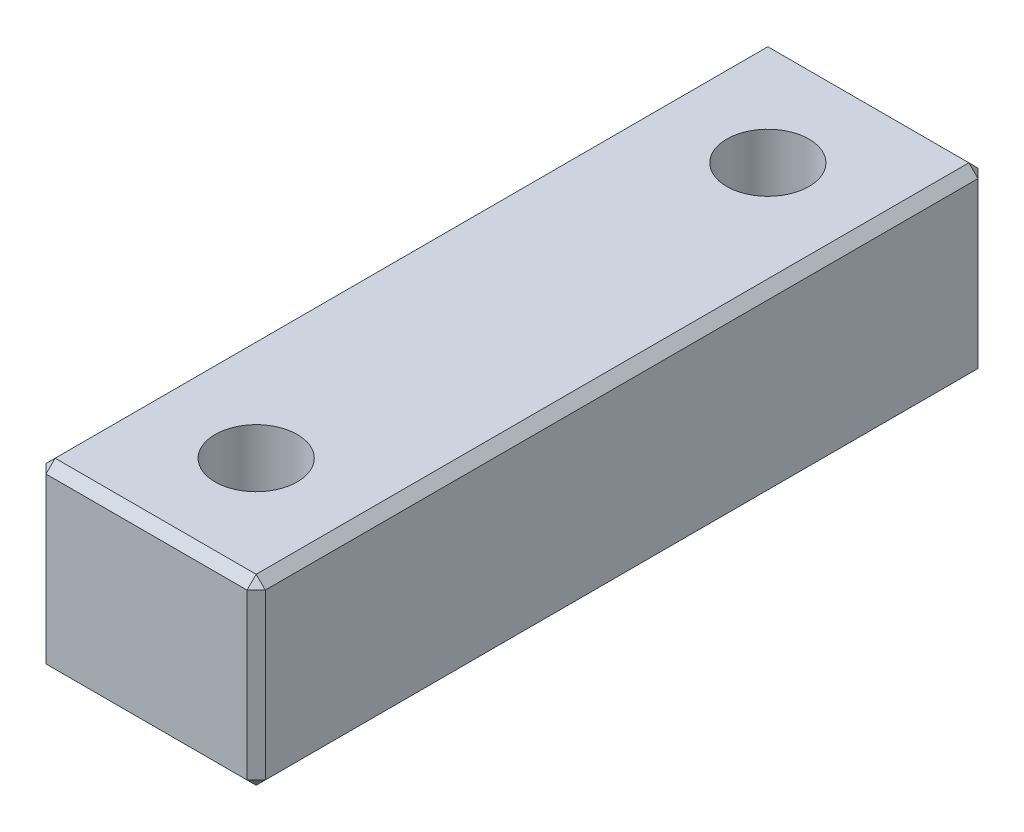
ISO-10303-21;
HEADER;
FILE_DESCRIPTION(('STEP AP214'),'2;1');
FILE_NAME('part.step','',(''),(''),'','','');
FILE_SCHEMA(('AUTOMOTIVE_DESIGN { 1 0 10303 214 1 1 1 1 }'));
ENDSEC;
DATA;
#1=APPLICATION_CONTEXT('core data for automotive mechanical design processes');
#2=APPLICATION_PROTOCOL_DEFINITION('international standard','automotive_design',2000,#1);
#3=PRODUCT_CONTEXT('',#1,'mechanical');
#4=PRODUCT('Part','Part','',(#3));
#5=PRODUCT_RELATED_PRODUCT_CATEGORY('part','',(#4));
#6=PRODUCT_DEFINITION_FORMATION('','',#4);
#7=PRODUCT_DEFINITION_CONTEXT('part definition',#1,'design');
#8=PRODUCT_DEFINITION('design','',#6,#7);
#9=PRODUCT_DEFINITION_SHAPE('','',#8);
#10=(LENGTH_UNIT() NAMED_UNIT(*) SI_UNIT(.MILLI.,.METRE.));
#11=(NAMED_UNIT(*) PLANE_ANGLE_UNIT() SI_UNIT($,.RADIAN.));
#12=(NAMED_UNIT(*) SI_UNIT($,.STERADIAN.) SOLID_ANGLE_UNIT());
#13=UNCERTAINTY_MEASURE_WITH_UNIT(LENGTH_MEASURE(1.E-05),#10,'distance_accuracy_value','');
#14=(GEOMETRIC_REPRESENTATION_CONTEXT(3) GLOBAL_UNCERTAINTY_ASSIGNED_CONTEXT((#13)) GLOBAL_UNIT_ASSIGNED_CONTEXT((#10,
#11,#12)) REPRESENTATION_CONTEXT('',''));
#15=CARTESIAN_POINT('',(0.,0.,0.));
#16=DIRECTION('',(0.,0.,1.));
#17=DIRECTION('',(1.,0.,0.));
#18=AXIS2_PLACEMENT_3D('',#15,#16,#17);
#19=CARTESIAN_POINT('',(-6.00000000000001,-5.00000000000001,20.));
#20=DIRECTION('',(1.,0.,0.));
#21=DIRECTION('',(0.,0.,-1.));
#22=AXIS2_PLACEMENT_3D('',#19,#20,#21);
#23=PLANE('',#22);
#24=DIRECTION('',(0.,1.,0.));
#25=VECTOR('',#24,1.);
#26=CARTESIAN_POINT('',(-6.00000000000001,4.99999999999999,19.5));
#27=LINE('',#26,#25);
#28=CARTESIAN_POINT('',(-6.00000000000001,-4.5,19.5));
#29=VERTEX_POINT('',#28);
#30=CARTESIAN_POINT('',(-6.00000000000001,4.49999999999999,19.5));
#31=VERTEX_POINT('',#30);
#32=EDGE_CURVE('E191',#29,#31,#27,.T.);
#33=ORIENTED_EDGE('',*,*,#32,.T.);
#34=DIRECTION('',(0.,0.,-1.));
#35=VECTOR('',#34,1.);
#36=CARTESIAN_POINT('',(-6.00000000000001,4.49999999999999,20.));
#37=LINE('',#36,#35);
#38=CARTESIAN_POINT('',(-6.00000000000001,4.49999999999999,-19.5));
#39=VERTEX_POINT('',#38);
#40=EDGE_CURVE('E193',#31,#39,#37,.T.);
#41=ORIENTED_EDGE('',*,*,#40,.T.);
#42=DIRECTION('',(0.,-1.,0.));
#43=VECTOR('',#42,1.);
#44=CARTESIAN_POINT('',(-6.00000000000001,-5.00000000000001,-19.5));
#45=LINE('',#44,#43);
#46=CARTESIAN_POINT('',(-6.00000000000001,-4.5,-19.5));
#47=VERTEX_POINT('',#46);
#48=EDGE_CURVE('E189',#39,#47,#45,.T.);
#49=ORIENTED_EDGE('',*,*,#48,.T.);
#50=DIRECTION('',(0.,0.,1.));
#51=VECTOR('',#50,1.);
#52=CARTESIAN_POINT('',(-6.00000000000001,-4.5,20.));
#53=LINE('',#52,#51);
#54=EDGE_CURVE('E187',#47,#29,#53,.T.);
#55=ORIENTED_EDGE('',*,*,#54,.T.);
#56=EDGE_LOOP('',(#33,#41,#49,#55));
#57=FACE_BOUND('',#56,.T.);
#58=ADVANCED_FACE('F32',(#57),#23,.F.);
#59=CARTESIAN_POINT('',(5.99999999999999,-5.,20.));
#60=DIRECTION('',(0.,1.,0.));
#61=DIRECTION('',(-1.,0.,0.));
#62=AXIS2_PLACEMENT_3D('',#59,#60,#61);
#63=PLANE('',#62);
#64=DIRECTION('',(0.,0.,-1.));
#65=VECTOR('',#64,1.);
#66=CARTESIAN_POINT('',(-5.50000000000001,-5.00000000000001,20.));
#67=LINE('',#66,#65);
#68=CARTESIAN_POINT('',(-5.50000000000001,-5.00000000000001,19.5));
#69=VERTEX_POINT('',#68);
#70=CARTESIAN_POINT('',(-5.50000000000001,-5.00000000000001,-19.5));
#71=VERTEX_POINT('',#70);
#72=EDGE_CURVE('E156',#69,#71,#67,.T.);
#73=ORIENTED_EDGE('',*,*,#72,.T.);
#74=DIRECTION('',(1.,0.,0.));
#75=VECTOR('',#74,1.);
#76=CARTESIAN_POINT('',(5.99999999999999,-5.,-19.5));
#77=LINE('',#76,#75);
#78=CARTESIAN_POINT('',(5.49999999999999,-5.,-19.5));
#79=VERTEX_POINT('',#78);
#80=EDGE_CURVE('E126',#71,#79,#77,.T.);
#81=ORIENTED_EDGE('',*,*,#80,.T.);
#82=DIRECTION('',(0.,0.,1.));
#83=VECTOR('',#82,1.);
#84=CARTESIAN_POINT('',(5.49999999999999,-5.,20.));
#85=LINE('',#84,#83);
#86=CARTESIAN_POINT('',(5.49999999999999,-5.,19.5));
#87=VERTEX_POINT('',#86);
#88=EDGE_CURVE('E144',#79,#87,#85,.T.);
#89=ORIENTED_EDGE('',*,*,#88,.T.);
#90=DIRECTION('',(-1.,0.,0.));
#91=VECTOR('',#90,1.);
#92=CARTESIAN_POINT('',(-6.00000000000001,-5.00000000000001,19.5));
#93=LINE('',#92,#91);
#94=EDGE_CURVE('E150',#87,#69,#93,.T.);
#95=ORIENTED_EDGE('',*,*,#94,.T.);
#96=EDGE_LOOP('',(#73,#81,#89,#95));
#97=FACE_BOUND('',#96,.T.);
#98=CARTESIAN_POINT('',(0.,-5.00000000000001,14.));
#99=DIRECTION('',(0.,-1.,0.));
#100=DIRECTION('',(-1.,0.,0.));
#101=AXIS2_PLACEMENT_3D('',#98,#99,#100);
#102=CIRCLE('',#101,4.);
#103=CARTESIAN_POINT('',(-4.,-5.00000000000001,14.));
#104=VERTEX_POINT('',#103);
#105=EDGE_CURVE('E257',#104,#104,#102,.T.);
#106=ORIENTED_EDGE('',*,*,#105,.F.);
#107=EDGE_LOOP('',(#106));
#108=FACE_BOUND('',#107,.T.);
#109=CARTESIAN_POINT('',(0.,-5.00000000000001,-14.));
#110=DIRECTION('',(0.,1.,0.));
#111=DIRECTION('',(-1.,0.,0.));
#112=AXIS2_PLACEMENT_3D('',#109,#110,#111);
#113=CIRCLE('',#112,4.);
#114=CARTESIAN_POINT('',(-4.,-5.00000000000001,-14.));
#115=VERTEX_POINT('',#114);
#116=EDGE_CURVE('E273',#115,#115,#113,.T.);
#117=ORIENTED_EDGE('',*,*,#116,.T.);
#118=EDGE_LOOP('',(#117));
#119=FACE_BOUND('',#118,.T.);
#120=ADVANCED_FACE('F153',(#97,#108,#119),#63,.F.);
#121=CARTESIAN_POINT('',(5.99999999999999,-5.,20.));
#122=DIRECTION('',(-1.,0.,0.));
#123=DIRECTION('',(0.,0.,1.));
#124=AXIS2_PLACEMENT_3D('',#121,#122,#123);
#125=PLANE('',#124);
#126=DIRECTION('',(0.,-1.,0.));
#127=VECTOR('',#126,1.);
#128=CARTESIAN_POINT('',(5.99999999999999,-5.,19.5));
#129=LINE('',#128,#127);
#130=CARTESIAN_POINT('',(5.99999999999999,4.5,19.5));
#131=VERTEX_POINT('',#130);
#132=CARTESIAN_POINT('',(5.99999999999999,-4.5,19.5));
#133=VERTEX_POINT('',#132);
#134=EDGE_CURVE('E41',#131,#133,#129,.T.);
#135=ORIENTED_EDGE('',*,*,#134,.T.);
#136=DIRECTION('',(0.,0.,-1.));
#137=VECTOR('',#136,1.);
#138=CARTESIAN_POINT('',(5.99999999999999,-4.5,20.));
#139=LINE('',#138,#137);
#140=CARTESIAN_POINT('',(5.99999999999999,-4.5,-19.5));
#141=VERTEX_POINT('',#140);
#142=EDGE_CURVE('E11',#133,#141,#139,.T.);
#143=ORIENTED_EDGE('',*,*,#142,.T.);
#144=DIRECTION('',(0.,1.,0.));
#145=VECTOR('',#144,1.);
#146=CARTESIAN_POINT('',(5.99999999999999,-5.,-19.5));
#147=LINE('',#146,#145);
#148=CARTESIAN_POINT('',(5.99999999999999,4.5,-19.5));
#149=VERTEX_POINT('',#148);
#150=EDGE_CURVE('E196',#141,#149,#147,.T.);
#151=ORIENTED_EDGE('',*,*,#150,.T.);
#152=DIRECTION('',(0.,0.,1.));
#153=VECTOR('',#152,1.);
#154=CARTESIAN_POINT('',(5.99999999999999,4.5,20.));
#155=LINE('',#154,#153);
#156=EDGE_CURVE('E52',#149,#131,#155,.T.);
#157=ORIENTED_EDGE('',*,*,#156,.T.);
#158=EDGE_LOOP('',(#135,#143,#151,#157));
#159=FACE_BOUND('',#158,.T.);
#160=ADVANCED_FACE('F308',(#159),#125,.F.);
#161=CARTESIAN_POINT('',(5.99999999999999,5.,20.));
#162=DIRECTION('',(0.,-1.,0.));
#163=DIRECTION('',(1.,0.,0.));
#164=AXIS2_PLACEMENT_3D('',#161,#162,#163);
#165=PLANE('',#164);
#166=DIRECTION('',(-1.,0.,0.));
#167=VECTOR('',#166,1.);
#168=CARTESIAN_POINT('',(5.99999999999999,5.,-19.5));
#169=LINE('',#168,#167);
#170=CARTESIAN_POINT('',(5.49999999999999,5.,-19.5));
#171=VERTEX_POINT('',#170);
#172=CARTESIAN_POINT('',(-5.5,4.99999999999999,-19.5));
#173=VERTEX_POINT('',#172);
#174=EDGE_CURVE('E173',#171,#173,#169,.T.);
#175=ORIENTED_EDGE('',*,*,#174,.T.);
#176=DIRECTION('',(0.,0.,1.));
#177=VECTOR('',#176,1.);
#178=CARTESIAN_POINT('',(-5.5,4.99999999999999,20.));
#179=LINE('',#178,#177);
#180=CARTESIAN_POINT('',(-5.5,4.99999999999999,19.5));
#181=VERTEX_POINT('',#180);
#182=EDGE_CURVE('E176',#173,#181,#179,.T.);
#183=ORIENTED_EDGE('',*,*,#182,.T.);
#184=DIRECTION('',(1.,0.,0.));
#185=VECTOR('',#184,1.);
#186=CARTESIAN_POINT('',(5.99999999999999,5.,19.5));
#187=LINE('',#186,#185);
#188=CARTESIAN_POINT('',(5.49999999999999,5.,19.5));
#189=VERTEX_POINT('',#188);
#190=EDGE_CURVE('E171',#181,#189,#187,.T.);
#191=ORIENTED_EDGE('',*,*,#190,.T.);
#192=DIRECTION('',(0.,0.,-1.));
#193=VECTOR('',#192,1.);
#194=CARTESIAN_POINT('',(5.49999999999999,5.,20.));
#195=LINE('',#194,#193);
#196=EDGE_CURVE('E169',#189,#171,#195,.T.);
#197=ORIENTED_EDGE('',*,*,#196,.T.);
#198=EDGE_LOOP('',(#175,#183,#191,#197));
#199=FACE_BOUND('',#198,.T.);
#200=CARTESIAN_POINT('',(0.,5.,14.));
#201=DIRECTION('',(0.,-1.,0.));
#202=DIRECTION('',(-1.,0.,0.));
#203=AXIS2_PLACEMENT_3D('',#200,#201,#202);
#204=CIRCLE('',#203,2.24999999999999);
#205=CARTESIAN_POINT('',(-2.25,4.99999999999999,14.));
#206=VERTEX_POINT('',#205);
#207=EDGE_CURVE('E268',#206,#206,#204,.T.);
#208=ORIENTED_EDGE('',*,*,#207,.T.);
#209=EDGE_LOOP('',(#208));
#210=FACE_BOUND('',#209,.T.);
#211=CARTESIAN_POINT('',(0.,5.,-14.));
#212=DIRECTION('',(0.,1.,0.));
#213=DIRECTION('',(-1.,0.,0.));
#214=AXIS2_PLACEMENT_3D('',#211,#212,#213);
#215=CIRCLE('',#214,2.24999999999999);
#216=CARTESIAN_POINT('',(-2.25,4.99999999999999,-14.));
#217=VERTEX_POINT('',#216);
#218=EDGE_CURVE('E151',#217,#217,#215,.T.);
#219=ORIENTED_EDGE('',*,*,#218,.F.);
#220=EDGE_LOOP('',(#219));
#221=FACE_BOUND('',#220,.T.);
#222=ADVANCED_FACE('F310',(#199,#210,#221),#165,.F.);
#223=CARTESIAN_POINT('',(-6.00000000000001,4.99999999999999,20.));
#224=DIRECTION('',(0.,0.,1.));
#225=DIRECTION('',(1.,0.,0.));
#226=AXIS2_PLACEMENT_3D('',#223,#224,#225);
#227=PLANE('',#226);
#228=DIRECTION('',(0.,1.,0.));
#229=VECTOR('',#228,1.);
#230=CARTESIAN_POINT('',(5.49999999999999,5.,20.));
#231=LINE('',#230,#229);
#232=CARTESIAN_POINT('',(5.49999999999999,-4.5,20.));
#233=VERTEX_POINT('',#232);
#234=CARTESIAN_POINT('',(5.49999999999999,4.5,20.));
#235=VERTEX_POINT('',#234);
#236=EDGE_CURVE('E178',#233,#235,#231,.T.);
#237=ORIENTED_EDGE('',*,*,#236,.T.);
#238=DIRECTION('',(-1.,0.,0.));
#239=VECTOR('',#238,1.);
#240=CARTESIAN_POINT('',(-6.00000000000001,4.49999999999999,20.));
#241=LINE('',#240,#239);
#242=CARTESIAN_POINT('',(-5.50000000000001,4.49999999999999,20.));
#243=VERTEX_POINT('',#242);
#244=EDGE_CURVE('E184',#235,#243,#241,.T.);
#245=ORIENTED_EDGE('',*,*,#244,.T.);
#246=DIRECTION('',(0.,-1.,0.));
#247=VECTOR('',#246,1.);
#248=CARTESIAN_POINT('',(-5.50000000000001,-5.00000000000001,20.));
#249=LINE('',#248,#247);
#250=CARTESIAN_POINT('',(-5.50000000000001,-4.50000000000001,20.));
#251=VERTEX_POINT('',#250);
#252=EDGE_CURVE('E182',#243,#251,#249,.T.);
#253=ORIENTED_EDGE('',*,*,#252,.T.);
#254=DIRECTION('',(1.,0.,0.));
#255=VECTOR('',#254,1.);
#256=CARTESIAN_POINT('',(5.99999999999999,-4.5,20.));
#257=LINE('',#256,#255);
#258=EDGE_CURVE('E180',#251,#233,#257,.T.);
#259=ORIENTED_EDGE('',*,*,#258,.T.);
#260=EDGE_LOOP('',(#237,#245,#253,#259));
#261=FACE_BOUND('',#260,.T.);
#262=ADVANCED_FACE('F316',(#261),#227,.T.);
#263=CARTESIAN_POINT('',(-6.00000000000001,4.99999999999999,-20.));
#264=DIRECTION('',(0.,0.,1.));
#265=DIRECTION('',(1.,0.,0.));
#266=AXIS2_PLACEMENT_3D('',#263,#264,#265);
#267=PLANE('',#266);
#268=DIRECTION('',(-1.,0.,0.));
#269=VECTOR('',#268,1.);
#270=CARTESIAN_POINT('',(-6.,-4.5,-20.));
#271=LINE('',#270,#269);
#272=CARTESIAN_POINT('',(5.49999999999999,-4.5,-20.));
#273=VERTEX_POINT('',#272);
#274=CARTESIAN_POINT('',(-5.5,-4.5,-20.));
#275=VERTEX_POINT('',#274);
#276=EDGE_CURVE('E128',#273,#275,#271,.T.);
#277=ORIENTED_EDGE('',*,*,#276,.T.);
#278=DIRECTION('',(0.,1.,0.));
#279=VECTOR('',#278,1.);
#280=CARTESIAN_POINT('',(-5.5,4.99999999999999,-20.));
#281=LINE('',#280,#279);
#282=CARTESIAN_POINT('',(-5.5,4.49999999999999,-20.));
#283=VERTEX_POINT('',#282);
#284=EDGE_CURVE('E167',#275,#283,#281,.T.);
#285=ORIENTED_EDGE('',*,*,#284,.T.);
#286=DIRECTION('',(1.,0.,0.));
#287=VECTOR('',#286,1.);
#288=CARTESIAN_POINT('',(-6.00000000000001,4.49999999999999,-20.));
#289=LINE('',#288,#287);
#290=CARTESIAN_POINT('',(5.49999999999999,4.49999999999999,-20.));
#291=VERTEX_POINT('',#290);
#292=EDGE_CURVE('E160',#283,#291,#289,.T.);
#293=ORIENTED_EDGE('',*,*,#292,.T.);
#294=DIRECTION('',(0.,-1.,0.));
#295=VECTOR('',#294,1.);
#296=CARTESIAN_POINT('',(5.49999999999999,4.99999999999999,-20.));
#297=LINE('',#296,#295);
#298=EDGE_CURVE('E158',#291,#273,#297,.T.);
#299=ORIENTED_EDGE('',*,*,#298,.T.);
#300=EDGE_LOOP('',(#277,#285,#293,#299));
#301=FACE_BOUND('',#300,.T.);
#302=ADVANCED_FACE('F302',(#301),#267,.F.);
#303=CARTESIAN_POINT('',(0.,4.99999999999999,-14.));
#304=DIRECTION('',(0.,1.,0.));
#305=DIRECTION('',(-1.,0.,0.));
#306=AXIS2_PLACEMENT_3D('',#303,#304,#305);
#307=CYLINDRICAL_SURFACE('',#306,2.25);
#308=CARTESIAN_POINT('',(0.,-3.20000000000001,-14.));
#309=DIRECTION('',(0.,1.,0.));
#310=DIRECTION('',(-1.,0.,0.));
#311=AXIS2_PLACEMENT_3D('',#308,#309,#310);
#312=CIRCLE('',#311,2.25);
#313=CARTESIAN_POINT('',(-2.25,-3.20000000000001,-14.));
#314=VERTEX_POINT('',#313);
#315=EDGE_CURVE('E276',#314,#314,#312,.T.);
#316=ORIENTED_EDGE('',*,*,#315,.F.);
#317=EDGE_LOOP('',(#316));
#318=FACE_BOUND('',#317,.T.);
#319=ORIENTED_EDGE('',*,*,#218,.T.);
#320=EDGE_LOOP('',(#319));
#321=FACE_BOUND('',#320,.T.);
#322=ADVANCED_FACE('F402',(#318,#321),#307,.F.);
#323=CARTESIAN_POINT('',(0.,-3.20000000000001,-14.));
#324=DIRECTION('',(0.,-1.,0.));
#325=DIRECTION('',(1.,0.,0.));
#326=AXIS2_PLACEMENT_3D('',#323,#324,#325);
#327=CONICAL_SURFACE('',#326,2.25,0.771314587574589);
#328=ORIENTED_EDGE('',*,*,#116,.F.);
#329=EDGE_LOOP('',(#328));
#330=FACE_BOUND('',#329,.T.);
#331=ORIENTED_EDGE('',*,*,#315,.T.);
#332=EDGE_LOOP('',(#331));
#333=FACE_BOUND('',#332,.T.);
#334=ADVANCED_FACE('F404',(#330,#333),#327,.F.);
#335=CARTESIAN_POINT('',(0.,4.99999999999999,14.));
#336=DIRECTION('',(0.,1.,0.));
#337=DIRECTION('',(-1.,0.,0.));
#338=AXIS2_PLACEMENT_3D('',#335,#336,#337);
#339=CYLINDRICAL_SURFACE('',#338,2.25);
#340=CARTESIAN_POINT('',(0.,-3.20000000000001,14.));
#341=DIRECTION('',(0.,-1.,0.));
#342=DIRECTION('',(-1.,0.,0.));
#343=AXIS2_PLACEMENT_3D('',#340,#341,#342);
#344=CIRCLE('',#343,2.25);
#345=CARTESIAN_POINT('',(-2.25,-3.20000000000001,14.));
#346=VERTEX_POINT('',#345);
#347=EDGE_CURVE('E263',#346,#346,#344,.T.);
#348=ORIENTED_EDGE('',*,*,#347,.T.);
#349=EDGE_LOOP('',(#348));
#350=FACE_BOUND('',#349,.T.);
#351=ORIENTED_EDGE('',*,*,#207,.F.);
#352=EDGE_LOOP('',(#351));
#353=FACE_BOUND('',#352,.T.);
#354=ADVANCED_FACE('F411',(#350,#353),#339,.F.);
#355=CARTESIAN_POINT('',(0.,-3.20000000000001,14.));
#356=DIRECTION('',(0.,-1.,0.));
#357=DIRECTION('',(1.,0.,0.));
#358=AXIS2_PLACEMENT_3D('',#355,#356,#357);
#359=CONICAL_SURFACE('',#358,2.25,0.771314587574589);
#360=ORIENTED_EDGE('',*,*,#105,.T.);
#361=EDGE_LOOP('',(#360));
#362=FACE_BOUND('',#361,.T.);
#363=ORIENTED_EDGE('',*,*,#347,.F.);
#364=EDGE_LOOP('',(#363));
#365=FACE_BOUND('',#364,.T.);
#366=ADVANCED_FACE('F383',(#362,#365),#359,.F.);
#367=CARTESIAN_POINT('',(-6.00000000000001,4.49999999999999,20.));
#368=DIRECTION('',(0.,0.70710678118655,0.707106781186545));
#369=DIRECTION('',(0.,-0.707106781186545,0.70710678118655));
#370=AXIS2_PLACEMENT_3D('',#367,#368,#369);
#371=PLANE('',#370);
#372=DIRECTION('',(0.,0.707106781186545,-0.70710678118655));
#373=VECTOR('',#372,1.);
#374=CARTESIAN_POINT('',(-5.50000000000001,4.49999999999999,20.));
#375=LINE('',#374,#373);
#376=EDGE_CURVE('E36',#243,#181,#375,.T.);
#377=ORIENTED_EDGE('',*,*,#376,.F.);
#378=ORIENTED_EDGE('',*,*,#244,.F.);
#379=DIRECTION('',(0.,-0.707106781186545,0.70710678118655));
#380=VECTOR('',#379,1.);
#381=CARTESIAN_POINT('',(5.49999999999999,5.,19.5));
#382=LINE('',#381,#380);
#383=EDGE_CURVE('E250',#189,#235,#382,.T.);
#384=ORIENTED_EDGE('',*,*,#383,.F.);
#385=ORIENTED_EDGE('',*,*,#190,.F.);
#386=EDGE_LOOP('',(#377,#378,#384,#385));
#387=FACE_BOUND('',#386,.T.);
#388=ADVANCED_FACE('F34',(#387),#371,.T.);
#389=CARTESIAN_POINT('',(-5.50000000000001,4.49999999999999,20.));
#390=DIRECTION('',(-0.577350269189626,0.577350269189629,0.577350269189621));
#391=DIRECTION('',(-0.707106781186549,-0.707106781186546,0.));
#392=AXIS2_PLACEMENT_3D('',#389,#390,#391);
#393=PLANE('',#392);
#394=DIRECTION('',(0.707106781186545,0.,0.70710678118655));
#395=VECTOR('',#394,1.);
#396=CARTESIAN_POINT('',(-5.50000000000001,4.49999999999999,20.));
#397=LINE('',#396,#395);
#398=EDGE_CURVE('E245',#243,#31,#397,.F.);
#399=ORIENTED_EDGE('',*,*,#398,.F.);
#400=ORIENTED_EDGE('',*,*,#376,.T.);
#401=DIRECTION('',(0.707106781186549,0.707106781186546,0.));
#402=VECTOR('',#401,1.);
#403=CARTESIAN_POINT('',(-5.75,4.74999999999999,19.5));
#404=LINE('',#403,#402);
#405=EDGE_CURVE('E248',#31,#181,#404,.T.);
#406=ORIENTED_EDGE('',*,*,#405,.F.);
#407=EDGE_LOOP('',(#399,#400,#406));
#408=FACE_BOUND('',#407,.T.);
#409=ADVANCED_FACE('F378',(#408),#393,.T.);
#410=CARTESIAN_POINT('',(5.49999999999999,5.,19.5));
#411=DIRECTION('',(0.577350269189622,0.57735026918963,0.577350269189626));
#412=DIRECTION('',(0.,-0.707106781186545,0.70710678118655));
#413=AXIS2_PLACEMENT_3D('',#410,#411,#412);
#414=PLANE('',#413);
#415=DIRECTION('',(0.70710678118655,-0.707106781186545,0.));
#416=VECTOR('',#415,1.);
#417=CARTESIAN_POINT('',(5.49999999999999,5.,19.5));
#418=LINE('',#417,#416);
#419=EDGE_CURVE('E240',#189,#131,#418,.T.);
#420=ORIENTED_EDGE('',*,*,#419,.F.);
#421=ORIENTED_EDGE('',*,*,#383,.T.);
#422=DIRECTION('',(0.70710678118655,0.,-0.707106781186545));
#423=VECTOR('',#422,1.);
#424=CARTESIAN_POINT('',(5.74999999999999,4.5,19.75));
#425=LINE('',#424,#423);
#426=EDGE_CURVE('E242',#131,#235,#425,.F.);
#427=ORIENTED_EDGE('',*,*,#426,.F.);
#428=EDGE_LOOP('',(#420,#421,#427));
#429=FACE_BOUND('',#428,.T.);
#430=ADVANCED_FACE('F375',(#429),#414,.T.);
#431=CARTESIAN_POINT('',(-6.00000000000001,4.49999999999999,20.));
#432=DIRECTION('',(0.707106781186546,-0.707106781186549,0.));
#433=DIRECTION('',(0.707106781186549,0.707106781186546,0.));
#434=AXIS2_PLACEMENT_3D('',#431,#432,#433);
#435=PLANE('',#434);
#436=ORIENTED_EDGE('',*,*,#405,.T.);
#437=ORIENTED_EDGE('',*,*,#182,.F.);
#438=DIRECTION('',(-0.707106781186549,-0.707106781186546,0.));
#439=VECTOR('',#438,1.);
#440=CARTESIAN_POINT('',(-5.5,4.99999999999999,-19.5));
#441=LINE('',#440,#439);
#442=EDGE_CURVE('E235',#39,#173,#441,.F.);
#443=ORIENTED_EDGE('',*,*,#442,.F.);
#444=ORIENTED_EDGE('',*,*,#40,.F.);
#445=EDGE_LOOP('',(#436,#437,#443,#444));
#446=FACE_BOUND('',#445,.T.);
#447=ADVANCED_FACE('F371',(#446),#435,.F.);
#448=CARTESIAN_POINT('',(-5.50000000000001,4.99999999999999,20.));
#449=DIRECTION('',(-0.70710678118655,0.,0.707106781186545));
#450=DIRECTION('',(0.707106781186545,0.,0.70710678118655));
#451=AXIS2_PLACEMENT_3D('',#448,#449,#450);
#452=PLANE('',#451);
#453=ORIENTED_EDGE('',*,*,#398,.T.);
#454=ORIENTED_EDGE('',*,*,#32,.F.);
#455=DIRECTION('',(-0.707106781186545,0.,-0.70710678118655));
#456=VECTOR('',#455,1.);
#457=CARTESIAN_POINT('',(-5.50000000000001,-4.50000000000001,20.));
#458=LINE('',#457,#456);
#459=EDGE_CURVE('E232',#251,#29,#458,.T.);
#460=ORIENTED_EDGE('',*,*,#459,.F.);
#461=ORIENTED_EDGE('',*,*,#252,.F.);
#462=EDGE_LOOP('',(#453,#454,#460,#461));
#463=FACE_BOUND('',#462,.T.);
#464=ADVANCED_FACE('F368',(#463),#452,.T.);
#465=CARTESIAN_POINT('',(-6.,-4.50000000000001,20.));
#466=DIRECTION('',(0.,-0.707106781186551,0.707106781186544));
#467=DIRECTION('',(0.,-0.707106781186544,-0.707106781186551));
#468=AXIS2_PLACEMENT_3D('',#465,#466,#467);
#469=PLANE('',#468);
#470=DIRECTION('',(0.,-0.707106781186544,-0.70710678118655));
#471=VECTOR('',#470,1.);
#472=CARTESIAN_POINT('',(5.49999999999999,-4.5,20.));
#473=LINE('',#472,#471);
#474=EDGE_CURVE('E226',#233,#87,#473,.T.);
#475=ORIENTED_EDGE('',*,*,#474,.F.);
#476=ORIENTED_EDGE('',*,*,#258,.F.);
#477=DIRECTION('',(0.,0.707106781186545,0.707106781186551));
#478=VECTOR('',#477,1.);
#479=CARTESIAN_POINT('',(-5.50000000000001,-4.50000000000001,20.));
#480=LINE('',#479,#478);
#481=EDGE_CURVE('E229',#69,#251,#480,.T.);
#482=ORIENTED_EDGE('',*,*,#481,.F.);
#483=ORIENTED_EDGE('',*,*,#94,.F.);
#484=EDGE_LOOP('',(#475,#476,#482,#483));
#485=FACE_BOUND('',#484,.T.);
#486=ADVANCED_FACE('F285',(#485),#469,.T.);
#487=CARTESIAN_POINT('',(5.49999999999999,4.99999999999999,20.));
#488=DIRECTION('',(0.707106781186545,0.,0.70710678118655));
#489=DIRECTION('',(0.70710678118655,0.,-0.707106781186545));
#490=AXIS2_PLACEMENT_3D('',#487,#488,#489);
#491=PLANE('',#490);
#492=ORIENTED_EDGE('',*,*,#426,.T.);
#493=ORIENTED_EDGE('',*,*,#236,.F.);
#494=DIRECTION('',(-0.70710678118655,0.,0.707106781186545));
#495=VECTOR('',#494,1.);
#496=CARTESIAN_POINT('',(5.49999999999999,-4.5,20.));
#497=LINE('',#496,#495);
#498=EDGE_CURVE('E223',#133,#233,#497,.T.);
#499=ORIENTED_EDGE('',*,*,#498,.F.);
#500=ORIENTED_EDGE('',*,*,#134,.F.);
#501=EDGE_LOOP('',(#492,#493,#499,#500));
#502=FACE_BOUND('',#501,.T.);
#503=ADVANCED_FACE('F361',(#502),#491,.T.);
#504=CARTESIAN_POINT('',(5.49999999999999,5.,20.));
#505=DIRECTION('',(-0.707106781186545,-0.70710678118655,0.));
#506=DIRECTION('',(0.70710678118655,-0.707106781186545,0.));
#507=AXIS2_PLACEMENT_3D('',#504,#505,#506);
#508=PLANE('',#507);
#509=ORIENTED_EDGE('',*,*,#419,.T.);
#510=ORIENTED_EDGE('',*,*,#156,.F.);
#511=DIRECTION('',(-0.70710678118655,0.707106781186545,0.));
#512=VECTOR('',#511,1.);
#513=CARTESIAN_POINT('',(5.74999999999999,4.75,-19.5));
#514=LINE('',#513,#512);
#515=EDGE_CURVE('E220',#171,#149,#514,.F.);
#516=ORIENTED_EDGE('',*,*,#515,.F.);
#517=ORIENTED_EDGE('',*,*,#196,.F.);
#518=EDGE_LOOP('',(#509,#510,#516,#517));
#519=FACE_BOUND('',#518,.T.);
#520=ADVANCED_FACE('F357',(#519),#508,.F.);
#521=CARTESIAN_POINT('',(5.99999999999999,5.,-19.5));
#522=DIRECTION('',(0.,-0.707106781186545,0.70710678118655));
#523=DIRECTION('',(0.,-0.70710678118655,-0.707106781186545));
#524=AXIS2_PLACEMENT_3D('',#521,#522,#523);
#525=PLANE('',#524);
#526=DIRECTION('',(0.,0.70710678118655,0.707106781186545));
#527=VECTOR('',#526,1.);
#528=CARTESIAN_POINT('',(-5.5,4.99999999999999,-19.5));
#529=LINE('',#528,#527);
#530=EDGE_CURVE('E237',#173,#283,#529,.F.);
#531=ORIENTED_EDGE('',*,*,#530,.F.);
#532=ORIENTED_EDGE('',*,*,#174,.F.);
#533=DIRECTION('',(0.,-0.70710678118655,-0.707106781186545));
#534=VECTOR('',#533,1.);
#535=CARTESIAN_POINT('',(5.49999999999999,4.49999999999999,-20.));
#536=LINE('',#535,#534);
#537=EDGE_CURVE('E217',#291,#171,#536,.F.);
#538=ORIENTED_EDGE('',*,*,#537,.F.);
#539=ORIENTED_EDGE('',*,*,#292,.F.);
#540=EDGE_LOOP('',(#531,#532,#538,#539));
#541=FACE_BOUND('',#540,.T.);
#542=ADVANCED_FACE('F353',(#541),#525,.F.);
#543=CARTESIAN_POINT('',(-5.5,4.99999999999999,-19.5));
#544=DIRECTION('',(-0.577350269189622,0.577350269189625,-0.577350269189629));
#545=DIRECTION('',(0.,0.70710678118655,0.707106781186545));
#546=AXIS2_PLACEMENT_3D('',#543,#544,#545);
#547=PLANE('',#546);
#548=ORIENTED_EDGE('',*,*,#442,.T.);
#549=ORIENTED_EDGE('',*,*,#530,.T.);
#550=DIRECTION('',(0.70710678118655,0.,-0.707106781186545));
#551=VECTOR('',#550,1.);
#552=CARTESIAN_POINT('',(-5.75,4.49999999999999,-19.75));
#553=LINE('',#552,#551);
#554=EDGE_CURVE('E214',#39,#283,#553,.T.);
#555=ORIENTED_EDGE('',*,*,#554,.F.);
#556=EDGE_LOOP('',(#548,#549,#555));
#557=FACE_BOUND('',#556,.T.);
#558=ADVANCED_FACE('F350',(#557),#547,.T.);
#559=CARTESIAN_POINT('',(-5.50000000000001,-4.50000000000001,20.));
#560=DIRECTION('',(-0.57735026918963,-0.577350269189626,0.577350269189621));
#561=DIRECTION('',(0.707106781186545,-0.70710678118655,0.));
#562=AXIS2_PLACEMENT_3D('',#559,#560,#561);
#563=PLANE('',#562);
#564=ORIENTED_EDGE('',*,*,#481,.T.);
#565=ORIENTED_EDGE('',*,*,#459,.T.);
#566=DIRECTION('',(-0.707106781186545,0.70710678118655,0.));
#567=VECTOR('',#566,1.);
#568=CARTESIAN_POINT('',(-5.75000000000001,-4.75000000000001,19.5));
#569=LINE('',#568,#567);
#570=EDGE_CURVE('E211',#69,#29,#569,.T.);
#571=ORIENTED_EDGE('',*,*,#570,.F.);
#572=EDGE_LOOP('',(#564,#565,#571));
#573=FACE_BOUND('',#572,.T.);
#574=ADVANCED_FACE('F288',(#573),#563,.T.);
#575=CARTESIAN_POINT('',(5.49999999999999,-4.5,20.));
#576=DIRECTION('',(0.577350269189622,-0.57735026918963,0.577350269189625));
#577=DIRECTION('',(0.,-0.707106781186544,-0.707106781186551));
#578=AXIS2_PLACEMENT_3D('',#575,#576,#577);
#579=PLANE('',#578);
#580=ORIENTED_EDGE('',*,*,#498,.T.);
#581=ORIENTED_EDGE('',*,*,#474,.T.);
#582=DIRECTION('',(-0.70710678118655,-0.707106781186545,0.));
#583=VECTOR('',#582,1.);
#584=CARTESIAN_POINT('',(5.74999999999999,-4.75,19.5));
#585=LINE('',#584,#583);
#586=EDGE_CURVE('E147',#133,#87,#585,.T.);
#587=ORIENTED_EDGE('',*,*,#586,.F.);
#588=EDGE_LOOP('',(#580,#581,#587));
#589=FACE_BOUND('',#588,.T.);
#590=ADVANCED_FACE('F343',(#589),#579,.T.);
#591=CARTESIAN_POINT('',(5.49999999999999,4.49999999999999,-20.));
#592=DIRECTION('',(0.577350269189622,0.577350269189626,-0.57735026918963));
#593=DIRECTION('',(0.,0.70710678118655,0.707106781186545));
#594=AXIS2_PLACEMENT_3D('',#591,#592,#593);
#595=PLANE('',#594);
#596=ORIENTED_EDGE('',*,*,#537,.T.);
#597=ORIENTED_EDGE('',*,*,#515,.T.);
#598=DIRECTION('',(0.70710678118655,0.,0.707106781186545));
#599=VECTOR('',#598,1.);
#600=CARTESIAN_POINT('',(5.49999999999999,4.49999999999999,-20.));
#601=LINE('',#600,#599);
#602=EDGE_CURVE('E207',#291,#149,#601,.T.);
#603=ORIENTED_EDGE('',*,*,#602,.F.);
#604=EDGE_LOOP('',(#596,#597,#603));
#605=FACE_BOUND('',#604,.T.);
#606=ADVANCED_FACE('F340',(#605),#595,.T.);
#607=CARTESIAN_POINT('',(-6.00000000000001,-5.00000000000001,-19.5));
#608=DIRECTION('',(0.707106781186545,0.,0.70710678118655));
#609=DIRECTION('',(0.70710678118655,0.,-0.707106781186545));
#610=AXIS2_PLACEMENT_3D('',#607,#608,#609);
#611=PLANE('',#610);
#612=ORIENTED_EDGE('',*,*,#554,.T.);
#613=ORIENTED_EDGE('',*,*,#284,.F.);
#614=DIRECTION('',(-0.70710678118655,0.,0.707106781186545));
#615=VECTOR('',#614,1.);
#616=CARTESIAN_POINT('',(-5.5,-4.5,-20.));
#617=LINE('',#616,#615);
#618=EDGE_CURVE('E204',#47,#275,#617,.F.);
#619=ORIENTED_EDGE('',*,*,#618,.F.);
#620=ORIENTED_EDGE('',*,*,#48,.F.);
#621=EDGE_LOOP('',(#612,#613,#619,#620));
#622=FACE_BOUND('',#621,.T.);
#623=ADVANCED_FACE('F298',(#622),#611,.F.);
#624=CARTESIAN_POINT('',(-5.50000000000001,-5.00000000000001,20.));
#625=DIRECTION('',(0.70710678118655,0.707106781186545,0.));
#626=DIRECTION('',(-0.707106781186545,0.70710678118655,0.));
#627=AXIS2_PLACEMENT_3D('',#624,#625,#626);
#628=PLANE('',#627);
#629=ORIENTED_EDGE('',*,*,#570,.T.);
#630=ORIENTED_EDGE('',*,*,#54,.F.);
#631=DIRECTION('',(0.707106781186545,-0.70710678118655,0.));
#632=VECTOR('',#631,1.);
#633=CARTESIAN_POINT('',(-5.75000000000001,-4.75000000000001,-19.5));
#634=LINE('',#633,#632);
#635=EDGE_CURVE('E141',#71,#47,#634,.F.);
#636=ORIENTED_EDGE('',*,*,#635,.F.);
#637=ORIENTED_EDGE('',*,*,#72,.F.);
#638=EDGE_LOOP('',(#629,#630,#636,#637));
#639=FACE_BOUND('',#638,.T.);
#640=ADVANCED_FACE('F291',(#639),#628,.F.);
#641=CARTESIAN_POINT('',(5.99999999999999,-4.5,20.));
#642=DIRECTION('',(-0.707106781186545,0.70710678118655,0.));
#643=DIRECTION('',(-0.70710678118655,-0.707106781186545,0.));
#644=AXIS2_PLACEMENT_3D('',#641,#642,#643);
#645=PLANE('',#644);
#646=ORIENTED_EDGE('',*,*,#586,.T.);
#647=ORIENTED_EDGE('',*,*,#88,.F.);
#648=DIRECTION('',(0.70710678118655,0.707106781186545,0.));
#649=VECTOR('',#648,1.);
#650=CARTESIAN_POINT('',(5.49999999999999,-5.,-19.5));
#651=LINE('',#650,#649);
#652=EDGE_CURVE('E133',#141,#79,#651,.F.);
#653=ORIENTED_EDGE('',*,*,#652,.F.);
#654=ORIENTED_EDGE('',*,*,#142,.F.);
#655=EDGE_LOOP('',(#646,#647,#653,#654));
#656=FACE_BOUND('',#655,.T.);
#657=ADVANCED_FACE('F145',(#656),#645,.F.);
#658=CARTESIAN_POINT('',(5.99999999999999,-5.,-19.5));
#659=DIRECTION('',(-0.707106781186545,0.,0.70710678118655));
#660=DIRECTION('',(0.70710678118655,0.,0.707106781186545));
#661=AXIS2_PLACEMENT_3D('',#658,#659,#660);
#662=PLANE('',#661);
#663=ORIENTED_EDGE('',*,*,#602,.T.);
#664=ORIENTED_EDGE('',*,*,#150,.F.);
#665=DIRECTION('',(-0.70710678118655,0.,-0.707106781186545));
#666=VECTOR('',#665,1.);
#667=CARTESIAN_POINT('',(5.74999999999999,-4.5,-19.75));
#668=LINE('',#667,#666);
#669=EDGE_CURVE('E137',#273,#141,#668,.F.);
#670=ORIENTED_EDGE('',*,*,#669,.F.);
#671=ORIENTED_EDGE('',*,*,#298,.F.);
#672=EDGE_LOOP('',(#663,#664,#670,#671));
#673=FACE_BOUND('',#672,.T.);
#674=ADVANCED_FACE('F306',(#673),#662,.F.);
#675=CARTESIAN_POINT('',(-5.5,-4.5,-20.));
#676=DIRECTION('',(-0.577350269189626,-0.577350269189622,-0.577350269189629));
#677=DIRECTION('',(-0.707106781186549,0.,0.707106781186546));
#678=AXIS2_PLACEMENT_3D('',#675,#676,#677);
#679=PLANE('',#678);
#680=ORIENTED_EDGE('',*,*,#635,.T.);
#681=ORIENTED_EDGE('',*,*,#618,.T.);
#682=DIRECTION('',(0.,0.70710678118655,-0.707106781186546));
#683=VECTOR('',#682,1.);
#684=CARTESIAN_POINT('',(-5.5,-4.5,-20.));
#685=LINE('',#684,#683);
#686=EDGE_CURVE('E130',#71,#275,#685,.T.);
#687=ORIENTED_EDGE('',*,*,#686,.F.);
#688=EDGE_LOOP('',(#680,#681,#687));
#689=FACE_BOUND('',#688,.T.);
#690=ADVANCED_FACE('F295',(#689),#679,.T.);
#691=CARTESIAN_POINT('',(5.49999999999999,-5.,-19.5));
#692=DIRECTION('',(0.577350269189622,-0.577350269189626,-0.577350269189629));
#693=DIRECTION('',(0.,0.707106781186549,-0.707106781186546));
#694=AXIS2_PLACEMENT_3D('',#691,#692,#693);
#695=PLANE('',#694);
#696=ORIENTED_EDGE('',*,*,#669,.T.);
#697=ORIENTED_EDGE('',*,*,#652,.T.);
#698=DIRECTION('',(0.,-0.707106781186549,0.707106781186546));
#699=VECTOR('',#698,1.);
#700=CARTESIAN_POINT('',(5.49999999999999,-5.,-19.5));
#701=LINE('',#700,#699);
#702=EDGE_CURVE('E122',#273,#79,#701,.T.);
#703=ORIENTED_EDGE('',*,*,#702,.F.);
#704=EDGE_LOOP('',(#696,#697,#703));
#705=FACE_BOUND('',#704,.T.);
#706=ADVANCED_FACE('F135',(#705),#695,.T.);
#707=CARTESIAN_POINT('',(5.99999999999999,-5.,-19.5));
#708=DIRECTION('',(0.,0.707106781186546,0.707106781186549));
#709=DIRECTION('',(0.,-0.707106781186549,0.707106781186546));
#710=AXIS2_PLACEMENT_3D('',#707,#708,#709);
#711=PLANE('',#710);
#712=ORIENTED_EDGE('',*,*,#686,.T.);
#713=ORIENTED_EDGE('',*,*,#276,.F.);
#714=ORIENTED_EDGE('',*,*,#702,.T.);
#715=ORIENTED_EDGE('',*,*,#80,.F.);
#716=EDGE_LOOP('',(#712,#713,#714,#715));
#717=FACE_BOUND('',#716,.T.);
#718=ADVANCED_FACE('F124',(#717),#711,.F.);
#719=CLOSED_SHELL('',(#58,#120,#160,#222,#262,#302,#322,#334,#354,#366,#388,#409,#430,#447,#464,
#486,#503,#520,#542,#558,#574,#590,#606,#623,#640,#657,#674,#690,#706,#718));
#720=MANIFOLD_SOLID_BREP('B2',#719);
#721=ADVANCED_BREP_SHAPE_REPRESENTATION('',(#18,#720),#14);
#722=SHAPE_DEFINITION_REPRESENTATION(#9,#721);
ENDSEC;
END-ISO-10303-21;
